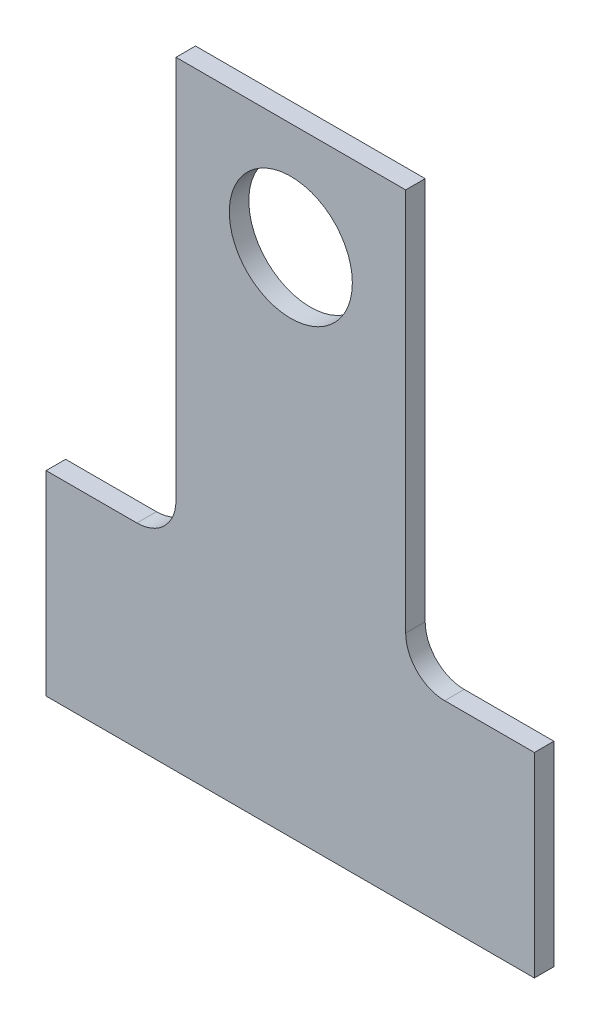
ISO-10303-21;
HEADER;
FILE_DESCRIPTION(('STEP AP214'),'2;1');
FILE_NAME('part.step','',(''),(''),'','','');
FILE_SCHEMA(('AUTOMOTIVE_DESIGN { 1 0 10303 214 1 1 1 1 }'));
ENDSEC;
DATA;
#1=APPLICATION_CONTEXT('core data for automotive mechanical design processes');
#2=APPLICATION_PROTOCOL_DEFINITION('international standard','automotive_design',2000,#1);
#3=PRODUCT_CONTEXT('',#1,'mechanical');
#4=PRODUCT('Part','Part','',(#3));
#5=PRODUCT_RELATED_PRODUCT_CATEGORY('part','',(#4));
#6=PRODUCT_DEFINITION_FORMATION('','',#4);
#7=PRODUCT_DEFINITION_CONTEXT('part definition',#1,'design');
#8=PRODUCT_DEFINITION('design','',#6,#7);
#9=PRODUCT_DEFINITION_SHAPE('','',#8);
#10=(LENGTH_UNIT() NAMED_UNIT(*) SI_UNIT(.MILLI.,.METRE.));
#11=(NAMED_UNIT(*) PLANE_ANGLE_UNIT() SI_UNIT($,.RADIAN.));
#12=(NAMED_UNIT(*) SI_UNIT($,.STERADIAN.) SOLID_ANGLE_UNIT());
#13=UNCERTAINTY_MEASURE_WITH_UNIT(LENGTH_MEASURE(1.E-05),#10,'distance_accuracy_value','');
#14=(GEOMETRIC_REPRESENTATION_CONTEXT(3) GLOBAL_UNCERTAINTY_ASSIGNED_CONTEXT((#13)) GLOBAL_UNIT_ASSIGNED_CONTEXT((#10,
#11,#12)) REPRESENTATION_CONTEXT('',''));
#15=CARTESIAN_POINT('',(0.,0.,0.));
#16=DIRECTION('',(0.,0.,1.));
#17=DIRECTION('',(1.,0.,0.));
#18=AXIS2_PLACEMENT_3D('',#15,#16,#17);
#19=CARTESIAN_POINT('',(-7.85000000000002,-6.,1.));
#20=DIRECTION('',(0.,-1.,0.));
#21=DIRECTION('',(0.,0.,-1.));
#22=AXIS2_PLACEMENT_3D('',#19,#20,#21);
#23=PLANE('',#22);
#24=DIRECTION('',(-1.,0.,0.));
#25=VECTOR('',#24,1.);
#26=CARTESIAN_POINT('',(-7.85000000000002,-6.,0.));
#27=LINE('',#26,#25);
#28=CARTESIAN_POINT('',(-7.85000000000002,-6.,0.));
#29=VERTEX_POINT('',#28);
#30=CARTESIAN_POINT('',(-12.5,-6.,0.));
#31=VERTEX_POINT('',#30);
#32=EDGE_CURVE('E141',#29,#31,#27,.T.);
#33=ORIENTED_EDGE('',*,*,#32,.T.);
#34=DIRECTION('',(0.,0.,-1.));
#35=VECTOR('',#34,1.);
#36=CARTESIAN_POINT('',(-12.5,-6.,1.));
#37=LINE('',#36,#35);
#38=CARTESIAN_POINT('',(-12.5,-6.,1.));
#39=VERTEX_POINT('',#38);
#40=EDGE_CURVE('E11',#39,#31,#37,.T.);
#41=ORIENTED_EDGE('',*,*,#40,.F.);
#42=DIRECTION('',(-1.,0.,0.));
#43=VECTOR('',#42,1.);
#44=CARTESIAN_POINT('',(-7.85000000000002,-6.,1.));
#45=LINE('',#44,#43);
#46=CARTESIAN_POINT('',(-7.85000000000002,-6.,1.));
#47=VERTEX_POINT('',#46);
#48=EDGE_CURVE('E160',#47,#39,#45,.T.);
#49=ORIENTED_EDGE('',*,*,#48,.F.);
#50=DIRECTION('',(0.,0.,-1.));
#51=VECTOR('',#50,1.);
#52=CARTESIAN_POINT('',(-7.85000000000002,-6.,1.));
#53=LINE('',#52,#51);
#54=EDGE_CURVE('E137',#47,#29,#53,.T.);
#55=ORIENTED_EDGE('',*,*,#54,.T.);
#56=EDGE_LOOP('',(#33,#41,#49,#55));
#57=FACE_BOUND('',#56,.T.);
#58=ADVANCED_FACE('F33',(#57),#23,.F.);
#59=CARTESIAN_POINT('',(-12.5,-6.,1.));
#60=DIRECTION('',(1.,0.,0.));
#61=DIRECTION('',(0.,0.,-1.));
#62=AXIS2_PLACEMENT_3D('',#59,#60,#61);
#63=PLANE('',#62);
#64=DIRECTION('',(0.,-1.,0.));
#65=VECTOR('',#64,1.);
#66=CARTESIAN_POINT('',(-12.5,-6.,0.));
#67=LINE('',#66,#65);
#68=CARTESIAN_POINT('',(-12.5,-16.,0.));
#69=VERTEX_POINT('',#68);
#70=EDGE_CURVE('E144',#31,#69,#67,.T.);
#71=ORIENTED_EDGE('',*,*,#70,.T.);
#72=DIRECTION('',(0.,0.,-1.));
#73=VECTOR('',#72,1.);
#74=CARTESIAN_POINT('',(-12.5,-16.,1.));
#75=LINE('',#74,#73);
#76=CARTESIAN_POINT('',(-12.5,-16.,1.));
#77=VERTEX_POINT('',#76);
#78=EDGE_CURVE('E41',#77,#69,#75,.T.);
#79=ORIENTED_EDGE('',*,*,#78,.F.);
#80=DIRECTION('',(0.,-1.,0.));
#81=VECTOR('',#80,1.);
#82=CARTESIAN_POINT('',(-12.5,-6.,1.));
#83=LINE('',#82,#81);
#84=EDGE_CURVE('E98',#39,#77,#83,.T.);
#85=ORIENTED_EDGE('',*,*,#84,.F.);
#86=ORIENTED_EDGE('',*,*,#40,.T.);
#87=EDGE_LOOP('',(#71,#79,#85,#86));
#88=FACE_BOUND('',#87,.T.);
#89=ADVANCED_FACE('F230',(#88),#63,.F.);
#90=CARTESIAN_POINT('',(-12.5,-16.,1.));
#91=DIRECTION('',(0.,1.,0.));
#92=DIRECTION('',(0.,0.,1.));
#93=AXIS2_PLACEMENT_3D('',#90,#91,#92);
#94=PLANE('',#93);
#95=DIRECTION('',(1.,0.,0.));
#96=VECTOR('',#95,1.);
#97=CARTESIAN_POINT('',(-12.5,-16.,0.));
#98=LINE('',#97,#96);
#99=CARTESIAN_POINT('',(12.5,-16.,0.));
#100=VERTEX_POINT('',#99);
#101=EDGE_CURVE('E147',#69,#100,#98,.T.);
#102=ORIENTED_EDGE('',*,*,#101,.T.);
#103=DIRECTION('',(0.,0.,-1.));
#104=VECTOR('',#103,1.);
#105=CARTESIAN_POINT('',(12.5,-16.,1.));
#106=LINE('',#105,#104);
#107=CARTESIAN_POINT('',(12.5,-16.,1.));
#108=VERTEX_POINT('',#107);
#109=EDGE_CURVE('E173',#108,#100,#106,.T.);
#110=ORIENTED_EDGE('',*,*,#109,.F.);
#111=DIRECTION('',(1.,0.,0.));
#112=VECTOR('',#111,1.);
#113=CARTESIAN_POINT('',(-12.5,-16.,1.));
#114=LINE('',#113,#112);
#115=EDGE_CURVE('E181',#77,#108,#114,.T.);
#116=ORIENTED_EDGE('',*,*,#115,.F.);
#117=ORIENTED_EDGE('',*,*,#78,.T.);
#118=EDGE_LOOP('',(#102,#110,#116,#117));
#119=FACE_BOUND('',#118,.T.);
#120=ADVANCED_FACE('F179',(#119),#94,.F.);
#121=CARTESIAN_POINT('',(12.5,-16.,1.));
#122=DIRECTION('',(-1.,0.,0.));
#123=DIRECTION('',(0.,0.,1.));
#124=AXIS2_PLACEMENT_3D('',#121,#122,#123);
#125=PLANE('',#124);
#126=DIRECTION('',(0.,1.,0.));
#127=VECTOR('',#126,1.);
#128=CARTESIAN_POINT('',(12.5,-16.,0.));
#129=LINE('',#128,#127);
#130=CARTESIAN_POINT('',(12.5,-6.,0.));
#131=VERTEX_POINT('',#130);
#132=EDGE_CURVE('E149',#100,#131,#129,.T.);
#133=ORIENTED_EDGE('',*,*,#132,.T.);
#134=DIRECTION('',(0.,0.,-1.));
#135=VECTOR('',#134,1.);
#136=CARTESIAN_POINT('',(12.5,-6.,1.));
#137=LINE('',#136,#135);
#138=CARTESIAN_POINT('',(12.5,-6.,1.));
#139=VERTEX_POINT('',#138);
#140=EDGE_CURVE('E170',#139,#131,#137,.T.);
#141=ORIENTED_EDGE('',*,*,#140,.F.);
#142=DIRECTION('',(0.,1.,0.));
#143=VECTOR('',#142,1.);
#144=CARTESIAN_POINT('',(12.5,-16.,1.));
#145=LINE('',#144,#143);
#146=EDGE_CURVE('E199',#108,#139,#145,.T.);
#147=ORIENTED_EDGE('',*,*,#146,.F.);
#148=ORIENTED_EDGE('',*,*,#109,.T.);
#149=EDGE_LOOP('',(#133,#141,#147,#148));
#150=FACE_BOUND('',#149,.T.);
#151=ADVANCED_FACE('F190',(#150),#125,.F.);
#152=CARTESIAN_POINT('',(7.91,-6.,1.));
#153=DIRECTION('',(0.,-1.,0.));
#154=DIRECTION('',(1.,0.,0.));
#155=AXIS2_PLACEMENT_3D('',#152,#153,#154);
#156=PLANE('',#155);
#157=DIRECTION('',(-1.,0.,0.));
#158=VECTOR('',#157,1.);
#159=CARTESIAN_POINT('',(7.91,-6.,0.));
#160=LINE('',#159,#158);
#161=CARTESIAN_POINT('',(7.91,-6.,0.));
#162=VERTEX_POINT('',#161);
#163=EDGE_CURVE('E151',#131,#162,#160,.T.);
#164=ORIENTED_EDGE('',*,*,#163,.T.);
#165=DIRECTION('',(0.,0.,-1.));
#166=VECTOR('',#165,1.);
#167=CARTESIAN_POINT('',(7.91,-6.,1.));
#168=LINE('',#167,#166);
#169=CARTESIAN_POINT('',(7.91,-6.,1.));
#170=VERTEX_POINT('',#169);
#171=EDGE_CURVE('E167',#170,#162,#168,.T.);
#172=ORIENTED_EDGE('',*,*,#171,.F.);
#173=DIRECTION('',(-1.,0.,0.));
#174=VECTOR('',#173,1.);
#175=CARTESIAN_POINT('',(7.91,-6.,1.));
#176=LINE('',#175,#174);
#177=EDGE_CURVE('E196',#139,#170,#176,.T.);
#178=ORIENTED_EDGE('',*,*,#177,.F.);
#179=ORIENTED_EDGE('',*,*,#140,.T.);
#180=EDGE_LOOP('',(#164,#172,#178,#179));
#181=FACE_BOUND('',#180,.T.);
#182=ADVANCED_FACE('F194',(#181),#156,.F.);
#183=CARTESIAN_POINT('',(7.91,-4.,1.));
#184=DIRECTION('',(0.,0.,-1.));
#185=DIRECTION('',(-1.,0.,0.));
#186=AXIS2_PLACEMENT_3D('',#183,#184,#185);
#187=CYLINDRICAL_SURFACE('',#186,2.);
#188=CARTESIAN_POINT('',(7.91,-4.,0.));
#189=DIRECTION('',(0.,0.,-1.));
#190=DIRECTION('',(1.,0.,0.));
#191=AXIS2_PLACEMENT_3D('',#188,#189,#190);
#192=CIRCLE('',#191,2.);
#193=CARTESIAN_POINT('',(5.91,-4.,0.));
#194=VERTEX_POINT('',#193);
#195=EDGE_CURVE('E153',#162,#194,#192,.T.);
#196=ORIENTED_EDGE('',*,*,#195,.T.);
#197=DIRECTION('',(0.,0.,-1.));
#198=VECTOR('',#197,1.);
#199=CARTESIAN_POINT('',(5.91,-4.,1.));
#200=LINE('',#199,#198);
#201=CARTESIAN_POINT('',(5.91,-4.,1.));
#202=VERTEX_POINT('',#201);
#203=EDGE_CURVE('E164',#202,#194,#200,.T.);
#204=ORIENTED_EDGE('',*,*,#203,.F.);
#205=CARTESIAN_POINT('',(7.91,-4.,1.));
#206=DIRECTION('',(0.,0.,-1.));
#207=DIRECTION('',(1.,0.,0.));
#208=AXIS2_PLACEMENT_3D('',#205,#206,#207);
#209=CIRCLE('',#208,2.);
#210=EDGE_CURVE('E198',#170,#202,#209,.T.);
#211=ORIENTED_EDGE('',*,*,#210,.F.);
#212=ORIENTED_EDGE('',*,*,#171,.T.);
#213=EDGE_LOOP('',(#196,#204,#211,#212));
#214=FACE_BOUND('',#213,.T.);
#215=ADVANCED_FACE('F242',(#214),#187,.F.);
#216=CARTESIAN_POINT('',(5.91,-4.,1.));
#217=DIRECTION('',(-1.,0.,0.));
#218=DIRECTION('',(0.,0.,1.));
#219=AXIS2_PLACEMENT_3D('',#216,#217,#218);
#220=PLANE('',#219);
#221=DIRECTION('',(0.,1.,0.));
#222=VECTOR('',#221,1.);
#223=CARTESIAN_POINT('',(5.91,-4.,0.));
#224=LINE('',#223,#222);
#225=CARTESIAN_POINT('',(5.91,15.65,0.));
#226=VERTEX_POINT('',#225);
#227=EDGE_CURVE('E155',#194,#226,#224,.T.);
#228=ORIENTED_EDGE('',*,*,#227,.T.);
#229=DIRECTION('',(0.,0.,-1.));
#230=VECTOR('',#229,1.);
#231=CARTESIAN_POINT('',(5.91,15.65,1.));
#232=LINE('',#231,#230);
#233=CARTESIAN_POINT('',(5.91,15.65,1.));
#234=VERTEX_POINT('',#233);
#235=EDGE_CURVE('E132',#234,#226,#232,.T.);
#236=ORIENTED_EDGE('',*,*,#235,.F.);
#237=DIRECTION('',(0.,1.,0.));
#238=VECTOR('',#237,1.);
#239=CARTESIAN_POINT('',(5.91,-4.,1.));
#240=LINE('',#239,#238);
#241=EDGE_CURVE('E123',#202,#234,#240,.T.);
#242=ORIENTED_EDGE('',*,*,#241,.F.);
#243=ORIENTED_EDGE('',*,*,#203,.T.);
#244=EDGE_LOOP('',(#228,#236,#242,#243));
#245=FACE_BOUND('',#244,.T.);
#246=ADVANCED_FACE('F239',(#245),#220,.F.);
#247=CARTESIAN_POINT('',(-5.85,15.65,1.));
#248=DIRECTION('',(0.,-1.,0.));
#249=DIRECTION('',(0.,0.,-1.));
#250=AXIS2_PLACEMENT_3D('',#247,#248,#249);
#251=PLANE('',#250);
#252=DIRECTION('',(-1.,0.,0.));
#253=VECTOR('',#252,1.);
#254=CARTESIAN_POINT('',(-5.85,15.65,0.));
#255=LINE('',#254,#253);
#256=CARTESIAN_POINT('',(-5.85,15.65,0.));
#257=VERTEX_POINT('',#256);
#258=EDGE_CURVE('E131',#226,#257,#255,.T.);
#259=ORIENTED_EDGE('',*,*,#258,.T.);
#260=DIRECTION('',(0.,0.,-1.));
#261=VECTOR('',#260,1.);
#262=CARTESIAN_POINT('',(-5.85,15.65,1.));
#263=LINE('',#262,#261);
#264=CARTESIAN_POINT('',(-5.85,15.65,1.));
#265=VERTEX_POINT('',#264);
#266=EDGE_CURVE('E128',#265,#257,#263,.T.);
#267=ORIENTED_EDGE('',*,*,#266,.F.);
#268=DIRECTION('',(-1.,0.,0.));
#269=VECTOR('',#268,1.);
#270=CARTESIAN_POINT('',(-5.85,15.65,1.));
#271=LINE('',#270,#269);
#272=EDGE_CURVE('E117',#234,#265,#271,.T.);
#273=ORIENTED_EDGE('',*,*,#272,.F.);
#274=ORIENTED_EDGE('',*,*,#235,.T.);
#275=EDGE_LOOP('',(#259,#267,#273,#274));
#276=FACE_BOUND('',#275,.T.);
#277=ADVANCED_FACE('F129',(#276),#251,.F.);
#278=CARTESIAN_POINT('',(-5.85,-3.99999999999998,1.));
#279=DIRECTION('',(1.,0.,0.));
#280=DIRECTION('',(0.,0.,-1.));
#281=AXIS2_PLACEMENT_3D('',#278,#279,#280);
#282=PLANE('',#281);
#283=DIRECTION('',(0.,-1.,0.));
#284=VECTOR('',#283,1.);
#285=CARTESIAN_POINT('',(-5.85,-3.99999999999998,0.));
#286=LINE('',#285,#284);
#287=CARTESIAN_POINT('',(-5.85,-3.99999999999998,0.));
#288=VERTEX_POINT('',#287);
#289=EDGE_CURVE('E84',#257,#288,#286,.T.);
#290=ORIENTED_EDGE('',*,*,#289,.T.);
#291=DIRECTION('',(0.,0.,-1.));
#292=VECTOR('',#291,1.);
#293=CARTESIAN_POINT('',(-5.85,-3.99999999999998,1.));
#294=LINE('',#293,#292);
#295=CARTESIAN_POINT('',(-5.85,-3.99999999999998,1.));
#296=VERTEX_POINT('',#295);
#297=EDGE_CURVE('E133',#296,#288,#294,.T.);
#298=ORIENTED_EDGE('',*,*,#297,.F.);
#299=DIRECTION('',(0.,-1.,0.));
#300=VECTOR('',#299,1.);
#301=CARTESIAN_POINT('',(-5.85,-3.99999999999998,1.));
#302=LINE('',#301,#300);
#303=EDGE_CURVE('E121',#265,#296,#302,.T.);
#304=ORIENTED_EDGE('',*,*,#303,.F.);
#305=ORIENTED_EDGE('',*,*,#266,.T.);
#306=EDGE_LOOP('',(#290,#298,#304,#305));
#307=FACE_BOUND('',#306,.T.);
#308=ADVANCED_FACE('F135',(#307),#282,.F.);
#309=CARTESIAN_POINT('',(-7.85,-4.,1.));
#310=DIRECTION('',(0.,0.,-1.));
#311=DIRECTION('',(-1.,0.,0.));
#312=AXIS2_PLACEMENT_3D('',#309,#310,#311);
#313=CYLINDRICAL_SURFACE('',#312,2.);
#314=CARTESIAN_POINT('',(-7.85,-4.,0.));
#315=DIRECTION('',(0.,0.,-1.));
#316=DIRECTION('',(-1.,0.,0.));
#317=AXIS2_PLACEMENT_3D('',#314,#315,#316);
#318=CIRCLE('',#317,2.);
#319=EDGE_CURVE('E90',#288,#29,#318,.T.);
#320=ORIENTED_EDGE('',*,*,#319,.T.);
#321=ORIENTED_EDGE('',*,*,#54,.F.);
#322=CARTESIAN_POINT('',(-7.85,-4.,1.));
#323=DIRECTION('',(0.,0.,-1.));
#324=DIRECTION('',(-1.,0.,0.));
#325=AXIS2_PLACEMENT_3D('',#322,#323,#324);
#326=CIRCLE('',#325,2.);
#327=EDGE_CURVE('E49',#296,#47,#326,.T.);
#328=ORIENTED_EDGE('',*,*,#327,.F.);
#329=ORIENTED_EDGE('',*,*,#297,.T.);
#330=EDGE_LOOP('',(#320,#321,#328,#329));
#331=FACE_BOUND('',#330,.T.);
#332=ADVANCED_FACE('F221',(#331),#313,.F.);
#333=CARTESIAN_POINT('',(7.91,-4.,1.));
#334=DIRECTION('',(0.,0.,1.));
#335=DIRECTION('',(1.,0.,0.));
#336=AXIS2_PLACEMENT_3D('',#333,#334,#335);
#337=PLANE('',#336);
#338=CARTESIAN_POINT('',(0.0300000000000005,10.16,1.));
#339=DIRECTION('',(0.,0.,1.));
#340=DIRECTION('',(1.,0.,0.));
#341=AXIS2_PLACEMENT_3D('',#338,#339,#340);
#342=CIRCLE('',#341,3.15);
#343=CARTESIAN_POINT('',(3.18,10.16,1.));
#344=VERTEX_POINT('',#343);
#345=EDGE_CURVE('E207',#344,#344,#342,.T.);
#346=ORIENTED_EDGE('',*,*,#345,.F.);
#347=EDGE_LOOP('',(#346));
#348=FACE_BOUND('',#347,.T.);
#349=ORIENTED_EDGE('',*,*,#48,.T.);
#350=ORIENTED_EDGE('',*,*,#84,.T.);
#351=ORIENTED_EDGE('',*,*,#115,.T.);
#352=ORIENTED_EDGE('',*,*,#146,.T.);
#353=ORIENTED_EDGE('',*,*,#177,.T.);
#354=ORIENTED_EDGE('',*,*,#210,.T.);
#355=ORIENTED_EDGE('',*,*,#241,.T.);
#356=ORIENTED_EDGE('',*,*,#272,.T.);
#357=ORIENTED_EDGE('',*,*,#303,.T.);
#358=ORIENTED_EDGE('',*,*,#327,.T.);
#359=EDGE_LOOP('',(#349,#350,#351,#352,#353,#354,#355,#356,#357,#358));
#360=FACE_BOUND('',#359,.T.);
#361=ADVANCED_FACE('F119',(#348,#360),#337,.T.);
#362=CARTESIAN_POINT('',(7.91,-4.,0.));
#363=DIRECTION('',(0.,0.,1.));
#364=DIRECTION('',(1.,0.,0.));
#365=AXIS2_PLACEMENT_3D('',#362,#363,#364);
#366=PLANE('',#365);
#367=CARTESIAN_POINT('',(0.0300000000000005,10.16,0.));
#368=DIRECTION('',(0.,0.,1.));
#369=DIRECTION('',(1.,0.,0.));
#370=AXIS2_PLACEMENT_3D('',#367,#368,#369);
#371=CIRCLE('',#370,3.15);
#372=CARTESIAN_POINT('',(3.18,10.16,0.));
#373=VERTEX_POINT('',#372);
#374=EDGE_CURVE('E145',#373,#373,#371,.T.);
#375=ORIENTED_EDGE('',*,*,#374,.T.);
#376=EDGE_LOOP('',(#375));
#377=FACE_BOUND('',#376,.T.);
#378=ORIENTED_EDGE('',*,*,#32,.F.);
#379=ORIENTED_EDGE('',*,*,#319,.F.);
#380=ORIENTED_EDGE('',*,*,#289,.F.);
#381=ORIENTED_EDGE('',*,*,#258,.F.);
#382=ORIENTED_EDGE('',*,*,#227,.F.);
#383=ORIENTED_EDGE('',*,*,#195,.F.);
#384=ORIENTED_EDGE('',*,*,#163,.F.);
#385=ORIENTED_EDGE('',*,*,#132,.F.);
#386=ORIENTED_EDGE('',*,*,#101,.F.);
#387=ORIENTED_EDGE('',*,*,#70,.F.);
#388=EDGE_LOOP('',(#378,#379,#380,#381,#382,#383,#384,#385,#386,#387));
#389=FACE_BOUND('',#388,.T.);
#390=ADVANCED_FACE('F185',(#377,#389),#366,.F.);
#391=CARTESIAN_POINT('',(0.0300000000000005,10.16,0.));
#392=DIRECTION('',(0.,0.,1.));
#393=DIRECTION('',(1.,0.,0.));
#394=AXIS2_PLACEMENT_3D('',#391,#392,#393);
#395=CYLINDRICAL_SURFACE('',#394,3.15);
#396=ORIENTED_EDGE('',*,*,#374,.F.);
#397=EDGE_LOOP('',(#396));
#398=FACE_BOUND('',#397,.T.);
#399=ORIENTED_EDGE('',*,*,#345,.T.);
#400=EDGE_LOOP('',(#399));
#401=FACE_BOUND('',#400,.T.);
#402=ADVANCED_FACE('F214',(#398,#401),#395,.F.);
#403=CLOSED_SHELL('',(#58,#89,#120,#151,#182,#215,#246,#277,#308,#332,#361,#390,#402));
#404=MANIFOLD_SOLID_BREP('B2',#403);
#405=ADVANCED_BREP_SHAPE_REPRESENTATION('',(#18,#404),#14);
#406=SHAPE_DEFINITION_REPRESENTATION(#9,#405);
ENDSEC;
END-ISO-10303-21;
